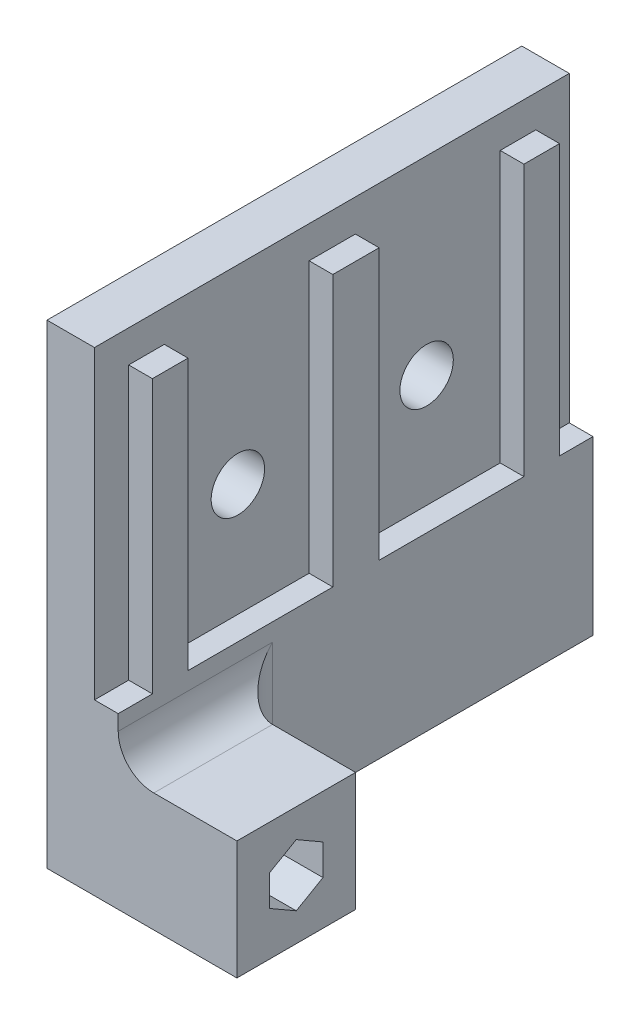
ISO-10303-21;
HEADER;
FILE_DESCRIPTION(('STEP AP214'),'2;1');
FILE_NAME('part.step','',(''),(''),'','','');
FILE_SCHEMA(('AUTOMOTIVE_DESIGN { 1 0 10303 214 1 1 1 1 }'));
ENDSEC;
DATA;
#1=APPLICATION_CONTEXT('core data for automotive mechanical design processes');
#2=APPLICATION_PROTOCOL_DEFINITION('international standard','automotive_design',2000,#1);
#3=PRODUCT_CONTEXT('',#1,'mechanical');
#4=PRODUCT('Part','Part','',(#3));
#5=PRODUCT_RELATED_PRODUCT_CATEGORY('part','',(#4));
#6=PRODUCT_DEFINITION_FORMATION('','',#4);
#7=PRODUCT_DEFINITION_CONTEXT('part definition',#1,'design');
#8=PRODUCT_DEFINITION('design','',#6,#7);
#9=PRODUCT_DEFINITION_SHAPE('','',#8);
#10=(LENGTH_UNIT() NAMED_UNIT(*) SI_UNIT(.MILLI.,.METRE.));
#11=(NAMED_UNIT(*) PLANE_ANGLE_UNIT() SI_UNIT($,.RADIAN.));
#12=(NAMED_UNIT(*) SI_UNIT($,.STERADIAN.) SOLID_ANGLE_UNIT());
#13=UNCERTAINTY_MEASURE_WITH_UNIT(LENGTH_MEASURE(1.E-05),#10,'distance_accuracy_value','');
#14=(GEOMETRIC_REPRESENTATION_CONTEXT(3) GLOBAL_UNCERTAINTY_ASSIGNED_CONTEXT((#13)) GLOBAL_UNIT_ASSIGNED_CONTEXT((#10,
#11,#12)) REPRESENTATION_CONTEXT('',''));
#15=CARTESIAN_POINT('',(0.,0.,0.));
#16=DIRECTION('',(0.,0.,1.));
#17=DIRECTION('',(1.,0.,0.));
#18=AXIS2_PLACEMENT_3D('',#15,#16,#17);
#19=CARTESIAN_POINT('',(-60.,0.,-40.));
#20=DIRECTION('',(1.,0.,0.));
#21=DIRECTION('',(0.,0.,-1.));
#22=AXIS2_PLACEMENT_3D('',#19,#20,#21);
#23=PLANE('',#22);
#24=DIRECTION('',(0.,0.,-1.));
#25=VECTOR('',#24,1.);
#26=CARTESIAN_POINT('',(-60.,37.2891898675992,-2.88103442719954));
#27=LINE('',#26,#25);
#28=CARTESIAN_POINT('',(-60.,37.2891898675992,-34.1810344271995));
#29=VERTEX_POINT('',#28);
#30=CARTESIAN_POINT('',(-60.,37.2891898675992,-37.1810344271995));
#31=VERTEX_POINT('',#30);
#32=EDGE_CURVE('E388',#29,#31,#27,.T.);
#33=ORIENTED_EDGE('',*,*,#32,.F.);
#34=DIRECTION('',(0.,1.,0.));
#35=VECTOR('',#34,1.);
#36=CARTESIAN_POINT('',(-60.,30.4891898675992,-34.1810344271995));
#37=LINE('',#36,#35);
#38=CARTESIAN_POINT('',(-60.,14.4891898675992,-34.1810344271995));
#39=VERTEX_POINT('',#38);
#40=EDGE_CURVE('E410',#39,#29,#37,.T.);
#41=ORIENTED_EDGE('',*,*,#40,.F.);
#42=DIRECTION('',(0.,0.,1.));
#43=VECTOR('',#42,1.);
#44=CARTESIAN_POINT('',(-60.,14.4891898675992,-34.1810344271995));
#45=LINE('',#44,#43);
#46=CARTESIAN_POINT('',(-60.,14.4891898675992,-21.9810344271995));
#47=VERTEX_POINT('',#46);
#48=EDGE_CURVE('E241',#39,#47,#45,.T.);
#49=ORIENTED_EDGE('',*,*,#48,.T.);
#50=DIRECTION('',(0.,-1.,0.));
#51=VECTOR('',#50,1.);
#52=CARTESIAN_POINT('',(-60.,30.4891898675992,-21.9810344271995));
#53=LINE('',#52,#51);
#54=CARTESIAN_POINT('',(-60.,37.2891898675992,-21.9810344271995));
#55=VERTEX_POINT('',#54);
#56=EDGE_CURVE('E412',#55,#47,#53,.T.);
#57=ORIENTED_EDGE('',*,*,#56,.F.);
#58=CARTESIAN_POINT('',(-60.,37.2891898675992,-18.0810344271995));
#59=VERTEX_POINT('',#58);
#60=EDGE_CURVE('E393',#59,#55,#27,.T.);
#61=ORIENTED_EDGE('',*,*,#60,.F.);
#62=DIRECTION('',(0.,1.,0.));
#63=VECTOR('',#62,1.);
#64=CARTESIAN_POINT('',(-60.,30.4891898675992,-18.0810344271995));
#65=LINE('',#64,#63);
#66=CARTESIAN_POINT('',(-60.,14.4891898675992,-18.0810344271995));
#67=VERTEX_POINT('',#66);
#68=EDGE_CURVE('E416',#67,#59,#65,.T.);
#69=ORIENTED_EDGE('',*,*,#68,.F.);
#70=DIRECTION('',(0.,0.,1.));
#71=VECTOR('',#70,1.);
#72=CARTESIAN_POINT('',(-60.,14.4891898675992,-18.0810344271995));
#73=LINE('',#72,#71);
#74=CARTESIAN_POINT('',(-60.,14.4891898675992,-5.88103442719954));
#75=VERTEX_POINT('',#74);
#76=EDGE_CURVE('E251',#67,#75,#73,.T.);
#77=ORIENTED_EDGE('',*,*,#76,.T.);
#78=DIRECTION('',(0.,-1.,0.));
#79=VECTOR('',#78,1.);
#80=CARTESIAN_POINT('',(-60.,30.4891898675992,-5.88103442719954));
#81=LINE('',#80,#79);
#82=CARTESIAN_POINT('',(-60.,37.2891898675992,-5.88103442719954));
#83=VERTEX_POINT('',#82);
#84=EDGE_CURVE('E233',#83,#75,#81,.T.);
#85=ORIENTED_EDGE('',*,*,#84,.F.);
#86=CARTESIAN_POINT('',(-60.,37.2891898675992,-2.88103442719954));
#87=VERTEX_POINT('',#86);
#88=EDGE_CURVE('E389',#87,#83,#27,.T.);
#89=ORIENTED_EDGE('',*,*,#88,.F.);
#90=DIRECTION('',(0.,1.,0.));
#91=VECTOR('',#90,1.);
#92=CARTESIAN_POINT('',(-60.,14.2891898675992,-2.88103442719954));
#93=LINE('',#92,#91);
#94=CARTESIAN_POINT('',(-60.,14.2891898675992,-2.88103442719954));
#95=VERTEX_POINT('',#94);
#96=EDGE_CURVE('E392',#95,#87,#93,.T.);
#97=ORIENTED_EDGE('',*,*,#96,.F.);
#98=DIRECTION('',(0.,0.,-1.));
#99=VECTOR('',#98,1.);
#100=CARTESIAN_POINT('',(-60.,14.2891898675992,-2.88103442719954));
#101=LINE('',#100,#99);
#102=CARTESIAN_POINT('',(-60.,14.2891898675992,0.));
#103=VERTEX_POINT('',#102);
#104=EDGE_CURVE('E380',#103,#95,#101,.T.);
#105=ORIENTED_EDGE('',*,*,#104,.F.);
#106=DIRECTION('',(0.,1.,0.));
#107=VECTOR('',#106,1.);
#108=CARTESIAN_POINT('',(-60.,0.,0.));
#109=LINE('',#108,#107);
#110=CARTESIAN_POINT('',(-60.,13.,0.));
#111=VERTEX_POINT('',#110);
#112=EDGE_CURVE('E352',#111,#103,#109,.T.);
#113=ORIENTED_EDGE('',*,*,#112,.F.);
#114=DIRECTION('',(0.,0.,-1.));
#115=VECTOR('',#114,1.);
#116=CARTESIAN_POINT('',(-60.,13.,-9.99999999999999));
#117=LINE('',#116,#115);
#118=CARTESIAN_POINT('',(-60.,13.,-13.));
#119=VERTEX_POINT('',#118);
#120=EDGE_CURVE('E329',#111,#119,#117,.T.);
#121=ORIENTED_EDGE('',*,*,#120,.T.);
#122=DIRECTION('',(0.,1.,0.));
#123=VECTOR('',#122,1.);
#124=CARTESIAN_POINT('',(-60.,0.,-13.));
#125=LINE('',#124,#123);
#126=CARTESIAN_POINT('',(-60.,0.,-13.));
#127=VERTEX_POINT('',#126);
#128=EDGE_CURVE('E332',#119,#127,#125,.F.);
#129=ORIENTED_EDGE('',*,*,#128,.T.);
#130=DIRECTION('',(0.,0.,1.));
#131=VECTOR('',#130,1.);
#132=CARTESIAN_POINT('',(-60.,0.,-40.));
#133=LINE('',#132,#131);
#134=CARTESIAN_POINT('',(-60.,0.,-40.));
#135=VERTEX_POINT('',#134);
#136=EDGE_CURVE('E345',#135,#127,#133,.T.);
#137=ORIENTED_EDGE('',*,*,#136,.F.);
#138=DIRECTION('',(0.,1.,0.));
#139=VECTOR('',#138,1.);
#140=CARTESIAN_POINT('',(-60.,0.,-40.));
#141=LINE('',#140,#139);
#142=CARTESIAN_POINT('',(-60.,14.5042950367177,-40.));
#143=VERTEX_POINT('',#142);
#144=EDGE_CURVE('E358',#135,#143,#141,.T.);
#145=ORIENTED_EDGE('',*,*,#144,.T.);
#146=DIRECTION('',(0.,0.,-1.));
#147=VECTOR('',#146,1.);
#148=CARTESIAN_POINT('',(-60.,14.5042950367177,-37.1810344271995));
#149=LINE('',#148,#147);
#150=CARTESIAN_POINT('',(-60.,14.5042950367177,-37.1810344271995));
#151=VERTEX_POINT('',#150);
#152=EDGE_CURVE('E382',#151,#143,#149,.T.);
#153=ORIENTED_EDGE('',*,*,#152,.F.);
#154=DIRECTION('',(0.,-1.,0.));
#155=VECTOR('',#154,1.);
#156=CARTESIAN_POINT('',(-60.,14.5042950367177,-37.1810344271995));
#157=LINE('',#156,#155);
#158=EDGE_CURVE('E385',#31,#151,#157,.T.);
#159=ORIENTED_EDGE('',*,*,#158,.F.);
#160=EDGE_LOOP('',(#33,#41,#49,#57,#61,#69,#77,#85,#89,#97,#105,#113,#121,#129,#137,#145,#153,#159));
#161=FACE_BOUND('',#160,.T.);
#162=ADVANCED_FACE('F33',(#161),#23,.T.);
#163=CARTESIAN_POINT('',(-62.,37.2891898675992,-2.88103442719954));
#164=DIRECTION('',(0.,-1.,0.));
#165=DIRECTION('',(0.,0.,-1.));
#166=AXIS2_PLACEMENT_3D('',#163,#164,#165);
#167=PLANE('',#166);
#168=DIRECTION('',(-1.,0.,0.));
#169=VECTOR('',#168,1.);
#170=CARTESIAN_POINT('',(-62.,37.2891898675992,-34.1810344271995));
#171=LINE('',#170,#169);
#172=CARTESIAN_POINT('',(-62.,37.2891898675992,-34.1810344271995));
#173=VERTEX_POINT('',#172);
#174=EDGE_CURVE('E228',#29,#173,#171,.T.);
#175=ORIENTED_EDGE('',*,*,#174,.F.);
#176=ORIENTED_EDGE('',*,*,#32,.T.);
#177=DIRECTION('',(1.,0.,0.));
#178=VECTOR('',#177,1.);
#179=CARTESIAN_POINT('',(-62.,37.2891898675992,-37.1810344271995));
#180=LINE('',#179,#178);
#181=CARTESIAN_POINT('',(-62.,37.2891898675992,-37.1810344271995));
#182=VERTEX_POINT('',#181);
#183=EDGE_CURVE('E373',#182,#31,#180,.T.);
#184=ORIENTED_EDGE('',*,*,#183,.F.);
#185=DIRECTION('',(0.,0.,-1.));
#186=VECTOR('',#185,1.);
#187=CARTESIAN_POINT('',(-62.,37.2891898675992,-2.88103442719954));
#188=LINE('',#187,#186);
#189=EDGE_CURVE('E403',#173,#182,#188,.T.);
#190=ORIENTED_EDGE('',*,*,#189,.F.);
#191=EDGE_LOOP('',(#175,#176,#184,#190));
#192=FACE_BOUND('',#191,.T.);
#193=ADVANCED_FACE('F537',(#192),#167,.F.);
#194=DIRECTION('',(1.,0.,0.));
#195=VECTOR('',#194,1.);
#196=CARTESIAN_POINT('',(-62.,37.2891898675992,-21.9810344271995));
#197=LINE('',#196,#195);
#198=CARTESIAN_POINT('',(-62.,37.2891898675992,-21.9810344271995));
#199=VERTEX_POINT('',#198);
#200=EDGE_CURVE('E257',#199,#55,#197,.T.);
#201=ORIENTED_EDGE('',*,*,#200,.F.);
#202=CARTESIAN_POINT('',(-62.,37.2891898675992,-18.0810344271995));
#203=VERTEX_POINT('',#202);
#204=EDGE_CURVE('E407',#203,#199,#188,.T.);
#205=ORIENTED_EDGE('',*,*,#204,.F.);
#206=DIRECTION('',(-1.,0.,0.));
#207=VECTOR('',#206,1.);
#208=CARTESIAN_POINT('',(-62.,37.2891898675992,-18.0810344271995));
#209=LINE('',#208,#207);
#210=EDGE_CURVE('E272',#59,#203,#209,.T.);
#211=ORIENTED_EDGE('',*,*,#210,.F.);
#212=ORIENTED_EDGE('',*,*,#60,.T.);
#213=EDGE_LOOP('',(#201,#205,#211,#212));
#214=FACE_BOUND('',#213,.T.);
#215=ADVANCED_FACE('F534',(#214),#167,.F.);
#216=DIRECTION('',(1.,0.,0.));
#217=VECTOR('',#216,1.);
#218=CARTESIAN_POINT('',(-62.,37.2891898675992,-5.88103442719954));
#219=LINE('',#218,#217);
#220=CARTESIAN_POINT('',(-62.,37.2891898675992,-5.88103442719954));
#221=VERTEX_POINT('',#220);
#222=EDGE_CURVE('E269',#221,#83,#219,.T.);
#223=ORIENTED_EDGE('',*,*,#222,.F.);
#224=CARTESIAN_POINT('',(-62.,37.2891898675992,-2.88103442719954));
#225=VERTEX_POINT('',#224);
#226=EDGE_CURVE('E404',#225,#221,#188,.T.);
#227=ORIENTED_EDGE('',*,*,#226,.F.);
#228=DIRECTION('',(1.,0.,0.));
#229=VECTOR('',#228,1.);
#230=CARTESIAN_POINT('',(-62.,37.2891898675992,-2.88103442719954));
#231=LINE('',#230,#229);
#232=EDGE_CURVE('E370',#225,#87,#231,.T.);
#233=ORIENTED_EDGE('',*,*,#232,.T.);
#234=ORIENTED_EDGE('',*,*,#88,.T.);
#235=EDGE_LOOP('',(#223,#227,#233,#234));
#236=FACE_BOUND('',#235,.T.);
#237=ADVANCED_FACE('F517',(#236),#167,.F.);
#238=CARTESIAN_POINT('',(-50.,0.,0.));
#239=DIRECTION('',(1.,0.,0.));
#240=DIRECTION('',(0.,0.,-1.));
#241=AXIS2_PLACEMENT_3D('',#238,#239,#240);
#242=PLANE('',#241);
#243=DIRECTION('',(0.,0.5,-0.866025403784438));
#244=VECTOR('',#243,1.);
#245=CARTESIAN_POINT('',(-50.,2.40192378864668,-4.99999999999999));
#246=LINE('',#245,#244);
#247=CARTESIAN_POINT('',(-50.,2.40192378864668,-4.99999999999999));
#248=VERTEX_POINT('',#247);
#249=CARTESIAN_POINT('',(-50.,3.70096189432334,-7.25));
#250=VERTEX_POINT('',#249);
#251=EDGE_CURVE('E50',#248,#250,#246,.T.);
#252=ORIENTED_EDGE('',*,*,#251,.F.);
#253=DIRECTION('',(0.,-0.5,-0.866025403784439));
#254=VECTOR('',#253,1.);
#255=CARTESIAN_POINT('',(-50.,3.70096189432334,-2.74999999999999));
#256=LINE('',#255,#254);
#257=CARTESIAN_POINT('',(-50.,3.70096189432334,-2.74999999999999));
#258=VERTEX_POINT('',#257);
#259=EDGE_CURVE('E279',#258,#248,#256,.T.);
#260=ORIENTED_EDGE('',*,*,#259,.F.);
#261=DIRECTION('',(0.,-1.,0.));
#262=VECTOR('',#261,1.);
#263=CARTESIAN_POINT('',(-50.,6.29903810567665,-2.74999999999999));
#264=LINE('',#263,#262);
#265=CARTESIAN_POINT('',(-50.,6.29903810567665,-2.74999999999999));
#266=VERTEX_POINT('',#265);
#267=EDGE_CURVE('E303',#266,#258,#264,.T.);
#268=ORIENTED_EDGE('',*,*,#267,.F.);
#269=DIRECTION('',(0.,-0.5,0.866025403784438));
#270=VECTOR('',#269,1.);
#271=CARTESIAN_POINT('',(-50.,7.59807621135331,-4.99999999999999));
#272=LINE('',#271,#270);
#273=CARTESIAN_POINT('',(-50.,7.59807621135331,-4.99999999999999));
#274=VERTEX_POINT('',#273);
#275=EDGE_CURVE('E300',#274,#266,#272,.T.);
#276=ORIENTED_EDGE('',*,*,#275,.F.);
#277=DIRECTION('',(0.,0.5,0.866025403784439));
#278=VECTOR('',#277,1.);
#279=CARTESIAN_POINT('',(-50.,6.29903810567666,-7.24999999999999));
#280=LINE('',#279,#278);
#281=CARTESIAN_POINT('',(-50.,6.29903810567666,-7.24999999999999));
#282=VERTEX_POINT('',#281);
#283=EDGE_CURVE('E297',#282,#274,#280,.T.);
#284=ORIENTED_EDGE('',*,*,#283,.F.);
#285=DIRECTION('',(0.,1.,0.));
#286=VECTOR('',#285,1.);
#287=CARTESIAN_POINT('',(-50.,3.70096189432334,-7.25));
#288=LINE('',#287,#286);
#289=EDGE_CURVE('E294',#250,#282,#288,.T.);
#290=ORIENTED_EDGE('',*,*,#289,.F.);
#291=EDGE_LOOP('',(#252,#260,#268,#276,#284,#290));
#292=FACE_BOUND('',#291,.T.);
#293=DIRECTION('',(0.,0.,-1.));
#294=VECTOR('',#293,1.);
#295=CARTESIAN_POINT('',(-50.,10.,0.));
#296=LINE('',#295,#294);
#297=CARTESIAN_POINT('',(-50.,10.,0.));
#298=VERTEX_POINT('',#297);
#299=CARTESIAN_POINT('',(-50.,10.,-9.99999999999999));
#300=VERTEX_POINT('',#299);
#301=EDGE_CURVE('E323',#298,#300,#296,.T.);
#302=ORIENTED_EDGE('',*,*,#301,.F.);
#303=DIRECTION('',(0.,-1.,0.));
#304=VECTOR('',#303,1.);
#305=CARTESIAN_POINT('',(-50.,10.,0.));
#306=LINE('',#305,#304);
#307=CARTESIAN_POINT('',(-50.,0.,0.));
#308=VERTEX_POINT('',#307);
#309=EDGE_CURVE('E441',#298,#308,#306,.T.);
#310=ORIENTED_EDGE('',*,*,#309,.T.);
#311=DIRECTION('',(0.,0.,-1.));
#312=VECTOR('',#311,1.);
#313=CARTESIAN_POINT('',(-50.,0.,0.));
#314=LINE('',#313,#312);
#315=CARTESIAN_POINT('',(-50.,0.,-9.99999999999999));
#316=VERTEX_POINT('',#315);
#317=EDGE_CURVE('E444',#308,#316,#314,.T.);
#318=ORIENTED_EDGE('',*,*,#317,.T.);
#319=DIRECTION('',(0.,1.,0.));
#320=VECTOR('',#319,1.);
#321=CARTESIAN_POINT('',(-50.,0.,-9.99999999999999));
#322=LINE('',#321,#320);
#323=EDGE_CURVE('E310',#316,#300,#322,.T.);
#324=ORIENTED_EDGE('',*,*,#323,.T.);
#325=EDGE_LOOP('',(#302,#310,#318,#324));
#326=FACE_BOUND('',#325,.T.);
#327=ADVANCED_FACE('F462',(#292,#326),#242,.T.);
#328=CARTESIAN_POINT('',(0.,10.,0.));
#329=DIRECTION('',(0.,0.,-1.));
#330=DIRECTION('',(-1.,0.,0.));
#331=AXIS2_PLACEMENT_3D('',#328,#329,#330);
#332=PLANE('',#331);
#333=ORIENTED_EDGE('',*,*,#309,.F.);
#334=DIRECTION('',(1.,0.,0.));
#335=VECTOR('',#334,1.);
#336=CARTESIAN_POINT('',(0.,10.,0.));
#337=LINE('',#336,#335);
#338=CARTESIAN_POINT('',(-57.,10.,0.));
#339=VERTEX_POINT('',#338);
#340=EDGE_CURVE('E344',#339,#298,#337,.T.);
#341=ORIENTED_EDGE('',*,*,#340,.F.);
#342=CARTESIAN_POINT('',(-57.,13.,0.));
#343=DIRECTION('',(0.,0.,-1.));
#344=DIRECTION('',(-1.,0.,0.));
#345=AXIS2_PLACEMENT_3D('',#342,#343,#344);
#346=CIRCLE('',#345,3.);
#347=EDGE_CURVE('E322',#339,#111,#346,.T.);
#348=ORIENTED_EDGE('',*,*,#347,.T.);
#349=ORIENTED_EDGE('',*,*,#112,.T.);
#350=DIRECTION('',(-1.,0.,0.));
#351=VECTOR('',#350,1.);
#352=CARTESIAN_POINT('',(0.,14.2891898675992,0.));
#353=LINE('',#352,#351);
#354=CARTESIAN_POINT('',(-62.,14.2891898675992,0.));
#355=VERTEX_POINT('',#354);
#356=EDGE_CURVE('E355',#103,#355,#353,.T.);
#357=ORIENTED_EDGE('',*,*,#356,.T.);
#358=DIRECTION('',(0.,1.,0.));
#359=VECTOR('',#358,1.);
#360=CARTESIAN_POINT('',(-62.,10.,0.));
#361=LINE('',#360,#359);
#362=CARTESIAN_POINT('',(-62.,40.,0.));
#363=VERTEX_POINT('',#362);
#364=EDGE_CURVE('E364',#355,#363,#361,.T.);
#365=ORIENTED_EDGE('',*,*,#364,.T.);
#366=DIRECTION('',(1.,0.,0.));
#367=VECTOR('',#366,1.);
#368=CARTESIAN_POINT('',(-70.,40.,0.));
#369=LINE('',#368,#367);
#370=CARTESIAN_POINT('',(-66.,40.,0.));
#371=VERTEX_POINT('',#370);
#372=EDGE_CURVE('E350',#371,#363,#369,.T.);
#373=ORIENTED_EDGE('',*,*,#372,.F.);
#374=DIRECTION('',(0.,1.,0.));
#375=VECTOR('',#374,1.);
#376=CARTESIAN_POINT('',(-66.,0.,0.));
#377=LINE('',#376,#375);
#378=CARTESIAN_POINT('',(-66.,0.,0.));
#379=VERTEX_POINT('',#378);
#380=EDGE_CURVE('E434',#379,#371,#377,.T.);
#381=ORIENTED_EDGE('',*,*,#380,.F.);
#382=DIRECTION('',(1.,0.,0.));
#383=VECTOR('',#382,1.);
#384=CARTESIAN_POINT('',(0.,0.,0.));
#385=LINE('',#384,#383);
#386=EDGE_CURVE('E349',#379,#308,#385,.T.);
#387=ORIENTED_EDGE('',*,*,#386,.T.);
#388=EDGE_LOOP('',(#333,#341,#348,#349,#357,#365,#373,#381,#387));
#389=FACE_BOUND('',#388,.T.);
#390=ADVANCED_FACE('F477',(#389),#332,.F.);
#391=CARTESIAN_POINT('',(0.,10.,0.));
#392=DIRECTION('',(0.,1.,0.));
#393=DIRECTION('',(0.,0.,1.));
#394=AXIS2_PLACEMENT_3D('',#391,#392,#393);
#395=PLANE('',#394);
#396=ORIENTED_EDGE('',*,*,#340,.T.);
#397=ORIENTED_EDGE('',*,*,#301,.T.);
#398=DIRECTION('',(1.,0.,0.));
#399=VECTOR('',#398,1.);
#400=CARTESIAN_POINT('',(0.,10.,-9.99999999999999));
#401=LINE('',#400,#399);
#402=CARTESIAN_POINT('',(-57.,10.,-9.99999999999999));
#403=VERTEX_POINT('',#402);
#404=EDGE_CURVE('E427',#403,#300,#401,.T.);
#405=ORIENTED_EDGE('',*,*,#404,.F.);
#406=DIRECTION('',(0.,0.,-1.));
#407=VECTOR('',#406,1.);
#408=CARTESIAN_POINT('',(-57.,10.,0.));
#409=LINE('',#408,#407);
#410=EDGE_CURVE('E327',#403,#339,#409,.F.);
#411=ORIENTED_EDGE('',*,*,#410,.T.);
#412=EDGE_LOOP('',(#396,#397,#405,#411));
#413=FACE_BOUND('',#412,.T.);
#414=ADVANCED_FACE('F458',(#413),#395,.T.);
#415=CARTESIAN_POINT('',(0.,0.,0.));
#416=DIRECTION('',(0.,1.,0.));
#417=DIRECTION('',(0.,0.,1.));
#418=AXIS2_PLACEMENT_3D('',#415,#416,#417);
#419=PLANE('',#418);
#420=ORIENTED_EDGE('',*,*,#317,.F.);
#421=ORIENTED_EDGE('',*,*,#386,.F.);
#422=DIRECTION('',(0.,0.,-1.));
#423=VECTOR('',#422,1.);
#424=CARTESIAN_POINT('',(-66.,0.,0.));
#425=LINE('',#424,#423);
#426=CARTESIAN_POINT('',(-66.,0.,-40.));
#427=VERTEX_POINT('',#426);
#428=EDGE_CURVE('E433',#379,#427,#425,.T.);
#429=ORIENTED_EDGE('',*,*,#428,.T.);
#430=DIRECTION('',(1.,0.,0.));
#431=VECTOR('',#430,1.);
#432=CARTESIAN_POINT('',(-70.,0.,-40.));
#433=LINE('',#432,#431);
#434=EDGE_CURVE('E353',#427,#135,#433,.T.);
#435=ORIENTED_EDGE('',*,*,#434,.T.);
#436=ORIENTED_EDGE('',*,*,#136,.T.);
#437=CARTESIAN_POINT('',(-57.,0.,-13.));
#438=DIRECTION('',(0.,1.,0.));
#439=DIRECTION('',(0.,0.,1.));
#440=AXIS2_PLACEMENT_3D('',#437,#438,#439);
#441=CIRCLE('',#440,3.);
#442=CARTESIAN_POINT('',(-57.,0.,-9.99999999999999));
#443=VERTEX_POINT('',#442);
#444=EDGE_CURVE('E320',#127,#443,#441,.T.);
#445=ORIENTED_EDGE('',*,*,#444,.T.);
#446=DIRECTION('',(1.,0.,0.));
#447=VECTOR('',#446,1.);
#448=CARTESIAN_POINT('',(-60.,0.,-9.99999999999999));
#449=LINE('',#448,#447);
#450=EDGE_CURVE('E37',#443,#316,#449,.T.);
#451=ORIENTED_EDGE('',*,*,#450,.T.);
#452=EDGE_LOOP('',(#420,#421,#429,#435,#436,#445,#451));
#453=FACE_BOUND('',#452,.T.);
#454=ADVANCED_FACE('F466',(#453),#419,.F.);
#455=CARTESIAN_POINT('',(-60.,0.,-9.99999999999999));
#456=DIRECTION('',(0.,0.,1.));
#457=DIRECTION('',(1.,0.,0.));
#458=AXIS2_PLACEMENT_3D('',#455,#456,#457);
#459=PLANE('',#458);
#460=ORIENTED_EDGE('',*,*,#323,.F.);
#461=ORIENTED_EDGE('',*,*,#450,.F.);
#462=DIRECTION('',(0.,1.,0.));
#463=VECTOR('',#462,1.);
#464=CARTESIAN_POINT('',(-57.,0.,-9.99999999999999));
#465=LINE('',#464,#463);
#466=EDGE_CURVE('E325',#443,#403,#465,.T.);
#467=ORIENTED_EDGE('',*,*,#466,.T.);
#468=ORIENTED_EDGE('',*,*,#404,.T.);
#469=EDGE_LOOP('',(#460,#461,#467,#468));
#470=FACE_BOUND('',#469,.T.);
#471=ADVANCED_FACE('F35',(#470),#459,.F.);
#472=CARTESIAN_POINT('',(-70.,40.,-40.));
#473=DIRECTION('',(0.,-1.,0.));
#474=DIRECTION('',(0.,0.,-1.));
#475=AXIS2_PLACEMENT_3D('',#472,#473,#474);
#476=PLANE('',#475);
#477=DIRECTION('',(1.,0.,0.));
#478=VECTOR('',#477,1.);
#479=CARTESIAN_POINT('',(-70.,40.,-40.));
#480=LINE('',#479,#478);
#481=CARTESIAN_POINT('',(-66.,40.,-40.));
#482=VERTEX_POINT('',#481);
#483=CARTESIAN_POINT('',(-62.,40.,-40.));
#484=VERTEX_POINT('',#483);
#485=EDGE_CURVE('E348',#482,#484,#480,.T.);
#486=ORIENTED_EDGE('',*,*,#485,.F.);
#487=DIRECTION('',(0.,0.,-1.));
#488=VECTOR('',#487,1.);
#489=CARTESIAN_POINT('',(-66.,40.,0.));
#490=LINE('',#489,#488);
#491=EDGE_CURVE('E42',#371,#482,#490,.T.);
#492=ORIENTED_EDGE('',*,*,#491,.F.);
#493=ORIENTED_EDGE('',*,*,#372,.T.);
#494=DIRECTION('',(0.,0.,-1.));
#495=VECTOR('',#494,1.);
#496=CARTESIAN_POINT('',(-62.,40.,-40.));
#497=LINE('',#496,#495);
#498=EDGE_CURVE('E367',#363,#484,#497,.T.);
#499=ORIENTED_EDGE('',*,*,#498,.T.);
#500=EDGE_LOOP('',(#486,#492,#493,#499));
#501=FACE_BOUND('',#500,.T.);
#502=ADVANCED_FACE('F487',(#501),#476,.F.);
#503=CARTESIAN_POINT('',(0.,0.,-40.));
#504=DIRECTION('',(0.,0.,1.));
#505=DIRECTION('',(1.,0.,0.));
#506=AXIS2_PLACEMENT_3D('',#503,#504,#505);
#507=PLANE('',#506);
#508=ORIENTED_EDGE('',*,*,#434,.F.);
#509=DIRECTION('',(0.,1.,0.));
#510=VECTOR('',#509,1.);
#511=CARTESIAN_POINT('',(-66.,0.,-40.));
#512=LINE('',#511,#510);
#513=EDGE_CURVE('E430',#427,#482,#512,.T.);
#514=ORIENTED_EDGE('',*,*,#513,.T.);
#515=ORIENTED_EDGE('',*,*,#485,.T.);
#516=DIRECTION('',(0.,-1.,0.));
#517=VECTOR('',#516,1.);
#518=CARTESIAN_POINT('',(-62.,0.,-40.));
#519=LINE('',#518,#517);
#520=CARTESIAN_POINT('',(-62.,14.5042950367177,-40.));
#521=VERTEX_POINT('',#520);
#522=EDGE_CURVE('E341',#484,#521,#519,.T.);
#523=ORIENTED_EDGE('',*,*,#522,.T.);
#524=DIRECTION('',(1.,0.,0.));
#525=VECTOR('',#524,1.);
#526=CARTESIAN_POINT('',(0.,14.5042950367177,-40.));
#527=LINE('',#526,#525);
#528=EDGE_CURVE('E334',#521,#143,#527,.T.);
#529=ORIENTED_EDGE('',*,*,#528,.T.);
#530=ORIENTED_EDGE('',*,*,#144,.F.);
#531=EDGE_LOOP('',(#508,#514,#515,#523,#529,#530));
#532=FACE_BOUND('',#531,.T.);
#533=ADVANCED_FACE('F491',(#532),#507,.F.);
#534=CARTESIAN_POINT('',(-62.,14.2891898675992,-2.88103442719954));
#535=DIRECTION('',(0.,-1.,0.));
#536=DIRECTION('',(0.,0.,-1.));
#537=AXIS2_PLACEMENT_3D('',#534,#535,#536);
#538=PLANE('',#537);
#539=ORIENTED_EDGE('',*,*,#104,.T.);
#540=DIRECTION('',(1.,0.,0.));
#541=VECTOR('',#540,1.);
#542=CARTESIAN_POINT('',(-62.,14.2891898675992,-2.88103442719954));
#543=LINE('',#542,#541);
#544=CARTESIAN_POINT('',(-62.,14.2891898675992,-2.88103442719954));
#545=VERTEX_POINT('',#544);
#546=EDGE_CURVE('E369',#545,#95,#543,.T.);
#547=ORIENTED_EDGE('',*,*,#546,.F.);
#548=DIRECTION('',(0.,0.,-1.));
#549=VECTOR('',#548,1.);
#550=CARTESIAN_POINT('',(-62.,14.2891898675992,-2.88103442719954));
#551=LINE('',#550,#549);
#552=EDGE_CURVE('E372',#355,#545,#551,.T.);
#553=ORIENTED_EDGE('',*,*,#552,.F.);
#554=ORIENTED_EDGE('',*,*,#356,.F.);
#555=EDGE_LOOP('',(#539,#547,#553,#554));
#556=FACE_BOUND('',#555,.T.);
#557=ADVANCED_FACE('F508',(#556),#538,.F.);
#558=CARTESIAN_POINT('',(-62.,14.5042950367177,-37.1810344271995));
#559=DIRECTION('',(0.,-1.,0.));
#560=DIRECTION('',(0.,0.,-1.));
#561=AXIS2_PLACEMENT_3D('',#558,#559,#560);
#562=PLANE('',#561);
#563=DIRECTION('',(0.,0.,-1.));
#564=VECTOR('',#563,1.);
#565=CARTESIAN_POINT('',(-62.,14.5042950367177,-37.1810344271995));
#566=LINE('',#565,#564);
#567=CARTESIAN_POINT('',(-62.,14.5042950367177,-37.1810344271995));
#568=VERTEX_POINT('',#567);
#569=EDGE_CURVE('E398',#568,#521,#566,.T.);
#570=ORIENTED_EDGE('',*,*,#569,.F.);
#571=DIRECTION('',(1.,0.,0.));
#572=VECTOR('',#571,1.);
#573=CARTESIAN_POINT('',(-62.,14.5042950367177,-37.1810344271995));
#574=LINE('',#573,#572);
#575=EDGE_CURVE('E376',#568,#151,#574,.T.);
#576=ORIENTED_EDGE('',*,*,#575,.T.);
#577=ORIENTED_EDGE('',*,*,#152,.T.);
#578=ORIENTED_EDGE('',*,*,#528,.F.);
#579=EDGE_LOOP('',(#570,#576,#577,#578));
#580=FACE_BOUND('',#579,.T.);
#581=ADVANCED_FACE('F496',(#580),#562,.F.);
#582=CARTESIAN_POINT('',(-62.,0.,0.));
#583=DIRECTION('',(-1.,0.,0.));
#584=DIRECTION('',(0.,0.,1.));
#585=AXIS2_PLACEMENT_3D('',#582,#583,#584);
#586=PLANE('',#585);
#587=ORIENTED_EDGE('',*,*,#522,.F.);
#588=ORIENTED_EDGE('',*,*,#498,.F.);
#589=ORIENTED_EDGE('',*,*,#364,.F.);
#590=ORIENTED_EDGE('',*,*,#552,.T.);
#591=DIRECTION('',(0.,1.,0.));
#592=VECTOR('',#591,1.);
#593=CARTESIAN_POINT('',(-62.,14.2891898675992,-2.88103442719954));
#594=LINE('',#593,#592);
#595=EDGE_CURVE('E383',#545,#225,#594,.T.);
#596=ORIENTED_EDGE('',*,*,#595,.T.);
#597=ORIENTED_EDGE('',*,*,#226,.T.);
#598=DIRECTION('',(0.,-1.,0.));
#599=VECTOR('',#598,1.);
#600=CARTESIAN_POINT('',(-62.,30.4891898675992,-5.88103442719954));
#601=LINE('',#600,#599);
#602=CARTESIAN_POINT('',(-62.,14.4891898675992,-5.88103442719954));
#603=VERTEX_POINT('',#602);
#604=EDGE_CURVE('E418',#221,#603,#601,.T.);
#605=ORIENTED_EDGE('',*,*,#604,.T.);
#606=DIRECTION('',(0.,0.,-1.));
#607=VECTOR('',#606,1.);
#608=CARTESIAN_POINT('',(-62.,14.4891898675992,-18.0810344271995));
#609=LINE('',#608,#607);
#610=CARTESIAN_POINT('',(-62.,14.4891898675992,-18.0810344271995));
#611=VERTEX_POINT('',#610);
#612=EDGE_CURVE('E258',#603,#611,#609,.T.);
#613=ORIENTED_EDGE('',*,*,#612,.T.);
#614=DIRECTION('',(0.,1.,0.));
#615=VECTOR('',#614,1.);
#616=CARTESIAN_POINT('',(-62.,30.4891898675992,-18.0810344271995));
#617=LINE('',#616,#615);
#618=EDGE_CURVE('E396',#611,#203,#617,.T.);
#619=ORIENTED_EDGE('',*,*,#618,.T.);
#620=ORIENTED_EDGE('',*,*,#204,.T.);
#621=DIRECTION('',(0.,-1.,0.));
#622=VECTOR('',#621,1.);
#623=CARTESIAN_POINT('',(-62.,30.4891898675992,-21.9810344271995));
#624=LINE('',#623,#622);
#625=CARTESIAN_POINT('',(-62.,14.4891898675992,-21.9810344271995));
#626=VERTEX_POINT('',#625);
#627=EDGE_CURVE('E232',#199,#626,#624,.T.);
#628=ORIENTED_EDGE('',*,*,#627,.T.);
#629=DIRECTION('',(0.,0.,-1.));
#630=VECTOR('',#629,1.);
#631=CARTESIAN_POINT('',(-62.,14.4891898675992,-34.1810344271995));
#632=LINE('',#631,#630);
#633=CARTESIAN_POINT('',(-62.,14.4891898675992,-34.1810344271995));
#634=VERTEX_POINT('',#633);
#635=EDGE_CURVE('E239',#626,#634,#632,.T.);
#636=ORIENTED_EDGE('',*,*,#635,.T.);
#637=DIRECTION('',(0.,1.,0.));
#638=VECTOR('',#637,1.);
#639=CARTESIAN_POINT('',(-62.,30.4891898675992,-34.1810344271995));
#640=LINE('',#639,#638);
#641=EDGE_CURVE('E222',#634,#173,#640,.T.);
#642=ORIENTED_EDGE('',*,*,#641,.T.);
#643=ORIENTED_EDGE('',*,*,#189,.T.);
#644=DIRECTION('',(0.,-1.,0.));
#645=VECTOR('',#644,1.);
#646=CARTESIAN_POINT('',(-62.,14.5042950367177,-37.1810344271995));
#647=LINE('',#646,#645);
#648=EDGE_CURVE('E400',#182,#568,#647,.T.);
#649=ORIENTED_EDGE('',*,*,#648,.T.);
#650=ORIENTED_EDGE('',*,*,#569,.T.);
#651=EDGE_LOOP('',(#587,#588,#589,#590,#596,#597,#605,#613,#619,#620,#628,#636,#642,#643,#649,#650));
#652=FACE_BOUND('',#651,.T.);
#653=CARTESIAN_POINT('',(-62.,23.9891898675992,-12.0810344271995));
#654=DIRECTION('',(1.,0.,0.));
#655=DIRECTION('',(0.,0.,-1.));
#656=AXIS2_PLACEMENT_3D('',#653,#654,#655);
#657=CIRCLE('',#656,2.25);
#658=CARTESIAN_POINT('',(-62.,23.9891898675992,-14.3310344271995));
#659=VERTEX_POINT('',#658);
#660=EDGE_CURVE('E424',#659,#659,#657,.T.);
#661=ORIENTED_EDGE('',*,*,#660,.F.);
#662=EDGE_LOOP('',(#661));
#663=FACE_BOUND('',#662,.T.);
#664=CARTESIAN_POINT('',(-62.,23.9891898675992,-27.9810344271995));
#665=DIRECTION('',(1.,0.,0.));
#666=DIRECTION('',(0.,0.,-1.));
#667=AXIS2_PLACEMENT_3D('',#664,#665,#666);
#668=CIRCLE('',#667,2.25);
#669=CARTESIAN_POINT('',(-62.,23.9891898675992,-30.2310344271995));
#670=VERTEX_POINT('',#669);
#671=EDGE_CURVE('E413',#670,#670,#668,.T.);
#672=ORIENTED_EDGE('',*,*,#671,.F.);
#673=EDGE_LOOP('',(#672));
#674=FACE_BOUND('',#673,.T.);
#675=ADVANCED_FACE('F244',(#652,#663,#674),#586,.F.);
#676=CARTESIAN_POINT('',(-62.,14.2891898675992,-2.88103442719954));
#677=DIRECTION('',(0.,0.,-1.));
#678=DIRECTION('',(-1.,0.,0.));
#679=AXIS2_PLACEMENT_3D('',#676,#677,#678);
#680=PLANE('',#679);
#681=ORIENTED_EDGE('',*,*,#96,.T.);
#682=ORIENTED_EDGE('',*,*,#232,.F.);
#683=ORIENTED_EDGE('',*,*,#595,.F.);
#684=ORIENTED_EDGE('',*,*,#546,.T.);
#685=EDGE_LOOP('',(#681,#682,#683,#684));
#686=FACE_BOUND('',#685,.T.);
#687=ADVANCED_FACE('F513',(#686),#680,.F.);
#688=CARTESIAN_POINT('',(-62.,14.5042950367177,-37.1810344271995));
#689=DIRECTION('',(0.,0.,1.));
#690=DIRECTION('',(0.,-1.,0.));
#691=AXIS2_PLACEMENT_3D('',#688,#689,#690);
#692=PLANE('',#691);
#693=ORIENTED_EDGE('',*,*,#158,.T.);
#694=ORIENTED_EDGE('',*,*,#575,.F.);
#695=ORIENTED_EDGE('',*,*,#648,.F.);
#696=ORIENTED_EDGE('',*,*,#183,.T.);
#697=EDGE_LOOP('',(#693,#694,#695,#696));
#698=FACE_BOUND('',#697,.T.);
#699=ADVANCED_FACE('F539',(#698),#692,.F.);
#700=CARTESIAN_POINT('',(-62.,30.4891898675992,-5.88103442719954));
#701=DIRECTION('',(0.,0.,1.));
#702=DIRECTION('',(0.,-1.,0.));
#703=AXIS2_PLACEMENT_3D('',#700,#701,#702);
#704=PLANE('',#703);
#705=ORIENTED_EDGE('',*,*,#84,.T.);
#706=DIRECTION('',(-1.,0.,0.));
#707=VECTOR('',#706,1.);
#708=CARTESIAN_POINT('',(-62.,14.4891898675992,-5.88103442719954));
#709=LINE('',#708,#707);
#710=EDGE_CURVE('E248',#75,#603,#709,.T.);
#711=ORIENTED_EDGE('',*,*,#710,.T.);
#712=ORIENTED_EDGE('',*,*,#604,.F.);
#713=ORIENTED_EDGE('',*,*,#222,.T.);
#714=EDGE_LOOP('',(#705,#711,#712,#713));
#715=FACE_BOUND('',#714,.T.);
#716=ADVANCED_FACE('F519',(#715),#704,.F.);
#717=CARTESIAN_POINT('',(-62.,30.4891898675992,-18.0810344271995));
#718=DIRECTION('',(0.,0.,-1.));
#719=DIRECTION('',(-1.,0.,0.));
#720=AXIS2_PLACEMENT_3D('',#717,#718,#719);
#721=PLANE('',#720);
#722=ORIENTED_EDGE('',*,*,#68,.T.);
#723=ORIENTED_EDGE('',*,*,#210,.T.);
#724=ORIENTED_EDGE('',*,*,#618,.F.);
#725=DIRECTION('',(1.,0.,0.));
#726=VECTOR('',#725,1.);
#727=CARTESIAN_POINT('',(-62.,14.4891898675992,-18.0810344271995));
#728=LINE('',#727,#726);
#729=EDGE_CURVE('E261',#611,#67,#728,.T.);
#730=ORIENTED_EDGE('',*,*,#729,.T.);
#731=EDGE_LOOP('',(#722,#723,#724,#730));
#732=FACE_BOUND('',#731,.T.);
#733=ADVANCED_FACE('F527',(#732),#721,.F.);
#734=CARTESIAN_POINT('',(-62.,30.4891898675992,-21.9810344271995));
#735=DIRECTION('',(0.,0.,1.));
#736=DIRECTION('',(1.,0.,0.));
#737=AXIS2_PLACEMENT_3D('',#734,#735,#736);
#738=PLANE('',#737);
#739=ORIENTED_EDGE('',*,*,#56,.T.);
#740=DIRECTION('',(-1.,0.,0.));
#741=VECTOR('',#740,1.);
#742=CARTESIAN_POINT('',(-62.,14.4891898675992,-21.9810344271995));
#743=LINE('',#742,#741);
#744=EDGE_CURVE('E255',#47,#626,#743,.T.);
#745=ORIENTED_EDGE('',*,*,#744,.T.);
#746=ORIENTED_EDGE('',*,*,#627,.F.);
#747=ORIENTED_EDGE('',*,*,#200,.T.);
#748=EDGE_LOOP('',(#739,#745,#746,#747));
#749=FACE_BOUND('',#748,.T.);
#750=ADVANCED_FACE('F541',(#749),#738,.F.);
#751=CARTESIAN_POINT('',(-62.,30.4891898675992,-34.1810344271995));
#752=DIRECTION('',(0.,0.,-1.));
#753=DIRECTION('',(0.,1.,0.));
#754=AXIS2_PLACEMENT_3D('',#751,#752,#753);
#755=PLANE('',#754);
#756=ORIENTED_EDGE('',*,*,#40,.T.);
#757=ORIENTED_EDGE('',*,*,#174,.T.);
#758=ORIENTED_EDGE('',*,*,#641,.F.);
#759=DIRECTION('',(1.,0.,0.));
#760=VECTOR('',#759,1.);
#761=CARTESIAN_POINT('',(-62.,14.4891898675992,-34.1810344271995));
#762=LINE('',#761,#760);
#763=EDGE_CURVE('E225',#634,#39,#762,.T.);
#764=ORIENTED_EDGE('',*,*,#763,.T.);
#765=EDGE_LOOP('',(#756,#757,#758,#764));
#766=FACE_BOUND('',#765,.T.);
#767=ADVANCED_FACE('F224',(#766),#755,.F.);
#768=CARTESIAN_POINT('',(-62.,23.9891898675992,-27.9810344271995));
#769=DIRECTION('',(1.,0.,0.));
#770=DIRECTION('',(0.,0.,-1.));
#771=AXIS2_PLACEMENT_3D('',#768,#769,#770);
#772=CYLINDRICAL_SURFACE('',#771,2.25);
#773=CARTESIAN_POINT('',(-66.,23.9891898675992,-27.9810344271995));
#774=DIRECTION('',(1.,0.,0.));
#775=DIRECTION('',(0.,0.,-1.));
#776=AXIS2_PLACEMENT_3D('',#773,#774,#775);
#777=CIRCLE('',#776,2.25);
#778=CARTESIAN_POINT('',(-66.,23.9891898675992,-30.2310344271995));
#779=VERTEX_POINT('',#778);
#780=EDGE_CURVE('E338',#779,#779,#777,.F.);
#781=ORIENTED_EDGE('',*,*,#780,.T.);
#782=EDGE_LOOP('',(#781));
#783=FACE_BOUND('',#782,.T.);
#784=ORIENTED_EDGE('',*,*,#671,.T.);
#785=EDGE_LOOP('',(#784));
#786=FACE_BOUND('',#785,.T.);
#787=ADVANCED_FACE('F548',(#783,#786),#772,.F.);
#788=CARTESIAN_POINT('',(-62.,23.9891898675992,-12.0810344271995));
#789=DIRECTION('',(1.,0.,0.));
#790=DIRECTION('',(0.,0.,-1.));
#791=AXIS2_PLACEMENT_3D('',#788,#789,#790);
#792=CYLINDRICAL_SURFACE('',#791,2.25);
#793=CARTESIAN_POINT('',(-66.,23.9891898675992,-12.0810344271995));
#794=DIRECTION('',(1.,0.,0.));
#795=DIRECTION('',(0.,0.,-1.));
#796=AXIS2_PLACEMENT_3D('',#793,#794,#795);
#797=CIRCLE('',#796,2.25);
#798=CARTESIAN_POINT('',(-66.,23.9891898675992,-14.3310344271995));
#799=VERTEX_POINT('',#798);
#800=EDGE_CURVE('E335',#799,#799,#797,.F.);
#801=ORIENTED_EDGE('',*,*,#800,.T.);
#802=EDGE_LOOP('',(#801));
#803=FACE_BOUND('',#802,.T.);
#804=ORIENTED_EDGE('',*,*,#660,.T.);
#805=EDGE_LOOP('',(#804));
#806=FACE_BOUND('',#805,.T.);
#807=ADVANCED_FACE('F649',(#803,#806),#792,.F.);
#808=CARTESIAN_POINT('',(-66.,0.,0.));
#809=DIRECTION('',(1.,0.,0.));
#810=DIRECTION('',(0.,0.,-1.));
#811=AXIS2_PLACEMENT_3D('',#808,#809,#810);
#812=PLANE('',#811);
#813=DIRECTION('',(0.,-0.5,-0.866025403784439));
#814=VECTOR('',#813,1.);
#815=CARTESIAN_POINT('',(-66.,3.70096189432334,-2.74999999999999));
#816=LINE('',#815,#814);
#817=CARTESIAN_POINT('',(-66.,3.70096189432334,-2.74999999999999));
#818=VERTEX_POINT('',#817);
#819=CARTESIAN_POINT('',(-66.,2.40192378864668,-4.99999999999999));
#820=VERTEX_POINT('',#819);
#821=EDGE_CURVE('E289',#818,#820,#816,.T.);
#822=ORIENTED_EDGE('',*,*,#821,.T.);
#823=DIRECTION('',(0.,0.5,-0.866025403784438));
#824=VECTOR('',#823,1.);
#825=CARTESIAN_POINT('',(-66.,2.40192378864668,-4.99999999999999));
#826=LINE('',#825,#824);
#827=CARTESIAN_POINT('',(-66.,3.70096189432334,-7.25));
#828=VERTEX_POINT('',#827);
#829=EDGE_CURVE('E275',#820,#828,#826,.T.);
#830=ORIENTED_EDGE('',*,*,#829,.T.);
#831=DIRECTION('',(0.,1.,0.));
#832=VECTOR('',#831,1.);
#833=CARTESIAN_POINT('',(-66.,3.70096189432334,-7.25));
#834=LINE('',#833,#832);
#835=CARTESIAN_POINT('',(-66.,6.29903810567666,-7.24999999999999));
#836=VERTEX_POINT('',#835);
#837=EDGE_CURVE('E278',#828,#836,#834,.T.);
#838=ORIENTED_EDGE('',*,*,#837,.T.);
#839=DIRECTION('',(0.,0.5,0.866025403784439));
#840=VECTOR('',#839,1.);
#841=CARTESIAN_POINT('',(-66.,6.29903810567666,-7.24999999999999));
#842=LINE('',#841,#840);
#843=CARTESIAN_POINT('',(-66.,7.59807621135331,-4.99999999999999));
#844=VERTEX_POINT('',#843);
#845=EDGE_CURVE('E58',#836,#844,#842,.T.);
#846=ORIENTED_EDGE('',*,*,#845,.T.);
#847=DIRECTION('',(0.,-0.5,0.866025403784438));
#848=VECTOR('',#847,1.);
#849=CARTESIAN_POINT('',(-66.,7.59807621135331,-4.99999999999999));
#850=LINE('',#849,#848);
#851=CARTESIAN_POINT('',(-66.,6.29903810567665,-2.74999999999999));
#852=VERTEX_POINT('',#851);
#853=EDGE_CURVE('E283',#844,#852,#850,.T.);
#854=ORIENTED_EDGE('',*,*,#853,.T.);
#855=DIRECTION('',(0.,-1.,0.));
#856=VECTOR('',#855,1.);
#857=CARTESIAN_POINT('',(-66.,6.29903810567665,-2.74999999999999));
#858=LINE('',#857,#856);
#859=EDGE_CURVE('E286',#852,#818,#858,.T.);
#860=ORIENTED_EDGE('',*,*,#859,.T.);
#861=EDGE_LOOP('',(#822,#830,#838,#846,#854,#860));
#862=FACE_BOUND('',#861,.T.);
#863=ORIENTED_EDGE('',*,*,#800,.F.);
#864=EDGE_LOOP('',(#863));
#865=FACE_BOUND('',#864,.T.);
#866=ORIENTED_EDGE('',*,*,#513,.F.);
#867=ORIENTED_EDGE('',*,*,#428,.F.);
#868=ORIENTED_EDGE('',*,*,#380,.T.);
#869=ORIENTED_EDGE('',*,*,#491,.T.);
#870=EDGE_LOOP('',(#866,#867,#868,#869));
#871=FACE_BOUND('',#870,.T.);
#872=ORIENTED_EDGE('',*,*,#780,.F.);
#873=EDGE_LOOP('',(#872));
#874=FACE_BOUND('',#873,.T.);
#875=ADVANCED_FACE('F483',(#862,#865,#871,#874),#812,.F.);
#876=CARTESIAN_POINT('',(-57.,0.,-13.));
#877=DIRECTION('',(0.,1.,0.));
#878=DIRECTION('',(0.,0.,1.));
#879=AXIS2_PLACEMENT_3D('',#876,#877,#878);
#880=CYLINDRICAL_SURFACE('',#879,3.);
#881=ORIENTED_EDGE('',*,*,#444,.F.);
#882=ORIENTED_EDGE('',*,*,#128,.F.);
#883=CARTESIAN_POINT('',(-57.,13.,-13.));
#884=DIRECTION('',(0.,0.707106781186547,0.707106781186547));
#885=DIRECTION('',(0.,0.707106781186547,-0.707106781186547));
#886=AXIS2_PLACEMENT_3D('',#883,#884,#885);
#887=ELLIPSE('',#886,4.24264068711928,3.);
#888=EDGE_CURVE('E11',#403,#119,#887,.F.);
#889=ORIENTED_EDGE('',*,*,#888,.F.);
#890=ORIENTED_EDGE('',*,*,#466,.F.);
#891=EDGE_LOOP('',(#881,#882,#889,#890));
#892=FACE_BOUND('',#891,.T.);
#893=ADVANCED_FACE('F470',(#892),#880,.F.);
#894=CARTESIAN_POINT('',(-57.,13.,-40.));
#895=DIRECTION('',(0.,0.,1.));
#896=DIRECTION('',(1.,0.,0.));
#897=AXIS2_PLACEMENT_3D('',#894,#895,#896);
#898=CYLINDRICAL_SURFACE('',#897,3.);
#899=ORIENTED_EDGE('',*,*,#347,.F.);
#900=ORIENTED_EDGE('',*,*,#410,.F.);
#901=ORIENTED_EDGE('',*,*,#888,.T.);
#902=ORIENTED_EDGE('',*,*,#120,.F.);
#903=EDGE_LOOP('',(#899,#900,#901,#902));
#904=FACE_BOUND('',#903,.T.);
#905=ADVANCED_FACE('F475',(#904),#898,.F.);
#906=CARTESIAN_POINT('',(-66.,2.40192378864668,-4.99999999999999));
#907=DIRECTION('',(0.,-0.866025403784438,-0.5));
#908=DIRECTION('',(0.,0.5,-0.866025403784438));
#909=AXIS2_PLACEMENT_3D('',#906,#907,#908);
#910=PLANE('',#909);
#911=ORIENTED_EDGE('',*,*,#251,.T.);
#912=DIRECTION('',(1.,0.,0.));
#913=VECTOR('',#912,1.);
#914=CARTESIAN_POINT('',(-66.,3.70096189432334,-7.25));
#915=LINE('',#914,#913);
#916=EDGE_CURVE('E292',#828,#250,#915,.T.);
#917=ORIENTED_EDGE('',*,*,#916,.F.);
#918=ORIENTED_EDGE('',*,*,#829,.F.);
#919=DIRECTION('',(1.,0.,0.));
#920=VECTOR('',#919,1.);
#921=CARTESIAN_POINT('',(-66.,2.40192378864668,-4.99999999999999));
#922=LINE('',#921,#920);
#923=EDGE_CURVE('E308',#820,#248,#922,.T.);
#924=ORIENTED_EDGE('',*,*,#923,.T.);
#925=EDGE_LOOP('',(#911,#917,#918,#924));
#926=FACE_BOUND('',#925,.T.);
#927=ADVANCED_FACE('F628',(#926),#910,.F.);
#928=CARTESIAN_POINT('',(-66.,3.70096189432334,-2.74999999999999));
#929=DIRECTION('',(0.,-0.866025403784439,0.5));
#930=DIRECTION('',(0.,-0.5,-0.866025403784439));
#931=AXIS2_PLACEMENT_3D('',#928,#929,#930);
#932=PLANE('',#931);
#933=ORIENTED_EDGE('',*,*,#259,.T.);
#934=ORIENTED_EDGE('',*,*,#923,.F.);
#935=ORIENTED_EDGE('',*,*,#821,.F.);
#936=DIRECTION('',(1.,0.,0.));
#937=VECTOR('',#936,1.);
#938=CARTESIAN_POINT('',(-66.,3.70096189432334,-2.74999999999999));
#939=LINE('',#938,#937);
#940=EDGE_CURVE('E311',#818,#258,#939,.T.);
#941=ORIENTED_EDGE('',*,*,#940,.T.);
#942=EDGE_LOOP('',(#933,#934,#935,#941));
#943=FACE_BOUND('',#942,.T.);
#944=ADVANCED_FACE('F624',(#943),#932,.F.);
#945=CARTESIAN_POINT('',(-66.,6.29903810567665,-2.74999999999999));
#946=DIRECTION('',(0.,0.,1.));
#947=DIRECTION('',(0.,-1.,0.));
#948=AXIS2_PLACEMENT_3D('',#945,#946,#947);
#949=PLANE('',#948);
#950=ORIENTED_EDGE('',*,*,#267,.T.);
#951=ORIENTED_EDGE('',*,*,#940,.F.);
#952=ORIENTED_EDGE('',*,*,#859,.F.);
#953=DIRECTION('',(1.,0.,0.));
#954=VECTOR('',#953,1.);
#955=CARTESIAN_POINT('',(-66.,6.29903810567665,-2.74999999999999));
#956=LINE('',#955,#954);
#957=EDGE_CURVE('E313',#852,#266,#956,.T.);
#958=ORIENTED_EDGE('',*,*,#957,.T.);
#959=EDGE_LOOP('',(#950,#951,#952,#958));
#960=FACE_BOUND('',#959,.T.);
#961=ADVANCED_FACE('F627',(#960),#949,.F.);
#962=CARTESIAN_POINT('',(-66.,7.59807621135331,-4.99999999999999));
#963=DIRECTION('',(0.,0.866025403784438,0.5));
#964=DIRECTION('',(0.,-0.5,0.866025403784438));
#965=AXIS2_PLACEMENT_3D('',#962,#963,#964);
#966=PLANE('',#965);
#967=ORIENTED_EDGE('',*,*,#275,.T.);
#968=ORIENTED_EDGE('',*,*,#957,.F.);
#969=ORIENTED_EDGE('',*,*,#853,.F.);
#970=DIRECTION('',(1.,0.,0.));
#971=VECTOR('',#970,1.);
#972=CARTESIAN_POINT('',(-66.,7.59807621135331,-4.99999999999999));
#973=LINE('',#972,#971);
#974=EDGE_CURVE('E315',#844,#274,#973,.T.);
#975=ORIENTED_EDGE('',*,*,#974,.T.);
#976=EDGE_LOOP('',(#967,#968,#969,#975));
#977=FACE_BOUND('',#976,.T.);
#978=ADVANCED_FACE('F632',(#977),#966,.F.);
#979=CARTESIAN_POINT('',(-66.,6.29903810567666,-7.24999999999999));
#980=DIRECTION('',(0.,0.866025403784439,-0.5));
#981=DIRECTION('',(0.,0.5,0.866025403784439));
#982=AXIS2_PLACEMENT_3D('',#979,#980,#981);
#983=PLANE('',#982);
#984=ORIENTED_EDGE('',*,*,#283,.T.);
#985=ORIENTED_EDGE('',*,*,#974,.F.);
#986=ORIENTED_EDGE('',*,*,#845,.F.);
#987=DIRECTION('',(1.,0.,0.));
#988=VECTOR('',#987,1.);
#989=CARTESIAN_POINT('',(-66.,6.29903810567666,-7.24999999999999));
#990=LINE('',#989,#988);
#991=EDGE_CURVE('E317',#836,#282,#990,.T.);
#992=ORIENTED_EDGE('',*,*,#991,.T.);
#993=EDGE_LOOP('',(#984,#985,#986,#992));
#994=FACE_BOUND('',#993,.T.);
#995=ADVANCED_FACE('F636',(#994),#983,.F.);
#996=CARTESIAN_POINT('',(-66.,3.70096189432334,-7.25));
#997=DIRECTION('',(0.,0.,-1.));
#998=DIRECTION('',(0.,1.,0.));
#999=AXIS2_PLACEMENT_3D('',#996,#997,#998);
#1000=PLANE('',#999);
#1001=ORIENTED_EDGE('',*,*,#289,.T.);
#1002=ORIENTED_EDGE('',*,*,#991,.F.);
#1003=ORIENTED_EDGE('',*,*,#837,.F.);
#1004=ORIENTED_EDGE('',*,*,#916,.T.);
#1005=EDGE_LOOP('',(#1001,#1002,#1003,#1004));
#1006=FACE_BOUND('',#1005,.T.);
#1007=ADVANCED_FACE('F611',(#1006),#1000,.F.);
#1008=CARTESIAN_POINT('',(0.,14.4891898675992,0.));
#1009=DIRECTION('',(0.,1.,0.));
#1010=DIRECTION('',(0.,0.,1.));
#1011=AXIS2_PLACEMENT_3D('',#1008,#1009,#1010);
#1012=PLANE('',#1011);
#1013=ORIENTED_EDGE('',*,*,#635,.F.);
#1014=ORIENTED_EDGE('',*,*,#744,.F.);
#1015=ORIENTED_EDGE('',*,*,#48,.F.);
#1016=ORIENTED_EDGE('',*,*,#763,.F.);
#1017=EDGE_LOOP('',(#1013,#1014,#1015,#1016));
#1018=FACE_BOUND('',#1017,.T.);
#1019=ADVANCED_FACE('F237',(#1018),#1012,.T.);
#1020=CARTESIAN_POINT('',(0.,14.4891898675992,0.));
#1021=DIRECTION('',(0.,1.,0.));
#1022=DIRECTION('',(0.,0.,1.));
#1023=AXIS2_PLACEMENT_3D('',#1020,#1021,#1022);
#1024=PLANE('',#1023);
#1025=ORIENTED_EDGE('',*,*,#612,.F.);
#1026=ORIENTED_EDGE('',*,*,#710,.F.);
#1027=ORIENTED_EDGE('',*,*,#76,.F.);
#1028=ORIENTED_EDGE('',*,*,#729,.F.);
#1029=EDGE_LOOP('',(#1025,#1026,#1027,#1028));
#1030=FACE_BOUND('',#1029,.T.);
#1031=ADVANCED_FACE('F524',(#1030),#1024,.T.);
#1032=CLOSED_SHELL('',(#162,#193,#215,#237,#327,#390,#414,#454,#471,#502,#533,#557,#581,#675,
#687,#699,#716,#733,#750,#767,#787,#807,#875,#893,#905,#927,#944,#961,#978,#995,#1007,#1019,#1031));
#1033=MANIFOLD_SOLID_BREP('B2',#1032);
#1034=ADVANCED_BREP_SHAPE_REPRESENTATION('',(#18,#1033),#14);
#1035=SHAPE_DEFINITION_REPRESENTATION(#9,#1034);
ENDSEC;
END-ISO-10303-21;
